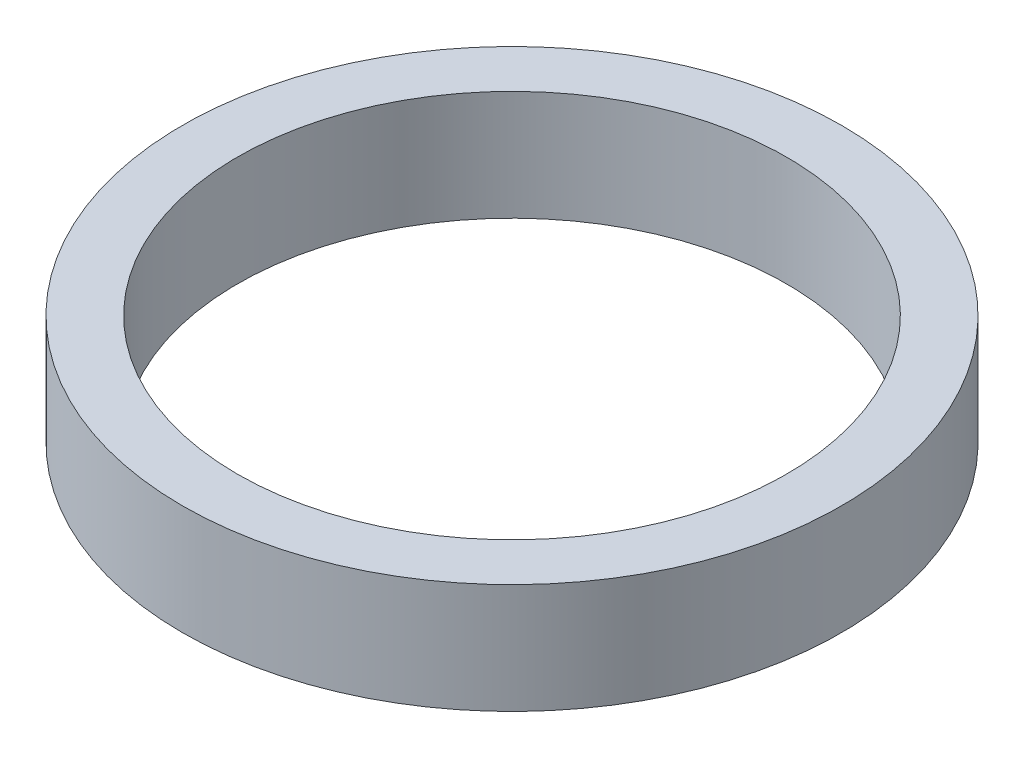
ISO-10303-21;
HEADER;
FILE_DESCRIPTION(('STEP AP214'),'2;1');
FILE_NAME('part.step','',(''),(''),'','','');
FILE_SCHEMA(('AUTOMOTIVE_DESIGN { 1 0 10303 214 1 1 1 1 }'));
ENDSEC;
DATA;
#1=APPLICATION_CONTEXT('core data for automotive mechanical design processes');
#2=APPLICATION_PROTOCOL_DEFINITION('international standard','automotive_design',2000,#1);
#3=PRODUCT_CONTEXT('',#1,'mechanical');
#4=PRODUCT('Part','Part','',(#3));
#5=PRODUCT_RELATED_PRODUCT_CATEGORY('part','',(#4));
#6=PRODUCT_DEFINITION_FORMATION('','',#4);
#7=PRODUCT_DEFINITION_CONTEXT('part definition',#1,'design');
#8=PRODUCT_DEFINITION('design','',#6,#7);
#9=PRODUCT_DEFINITION_SHAPE('','',#8);
#10=(LENGTH_UNIT() NAMED_UNIT(*) SI_UNIT(.MILLI.,.METRE.));
#11=(NAMED_UNIT(*) PLANE_ANGLE_UNIT() SI_UNIT($,.RADIAN.));
#12=(NAMED_UNIT(*) SI_UNIT($,.STERADIAN.) SOLID_ANGLE_UNIT());
#13=UNCERTAINTY_MEASURE_WITH_UNIT(LENGTH_MEASURE(1.E-05),#10,'distance_accuracy_value','');
#14=(GEOMETRIC_REPRESENTATION_CONTEXT(3) GLOBAL_UNCERTAINTY_ASSIGNED_CONTEXT((#13)) GLOBAL_UNIT_ASSIGNED_CONTEXT((#10,
#11,#12)) REPRESENTATION_CONTEXT('',''));
#15=CARTESIAN_POINT('',(0.,0.,0.));
#16=DIRECTION('',(0.,0.,1.));
#17=DIRECTION('',(1.,0.,0.));
#18=AXIS2_PLACEMENT_3D('',#15,#16,#17);
#19=CARTESIAN_POINT('',(0.,20.,0.));
#20=DIRECTION('',(0.,-1.,0.));
#21=DIRECTION('',(0.,0.,-1.));
#22=AXIS2_PLACEMENT_3D('',#19,#20,#21);
#23=CYLINDRICAL_SURFACE('',#22,60.);
#24=CARTESIAN_POINT('',(0.,20.,0.));
#25=DIRECTION('',(0.,1.,0.));
#26=DIRECTION('',(0.,0.,1.));
#27=AXIS2_PLACEMENT_3D('',#24,#25,#26);
#28=CIRCLE('',#27,60.);
#29=CARTESIAN_POINT('',(0.,20.,60.));
#30=VERTEX_POINT('',#29);
#31=EDGE_CURVE('E10',#30,#30,#28,.T.);
#32=ORIENTED_EDGE('',*,*,#31,.F.);
#33=EDGE_LOOP('',(#32));
#34=FACE_BOUND('',#33,.T.);
#35=CARTESIAN_POINT('',(0.,0.,0.));
#36=DIRECTION('',(0.,1.,0.));
#37=DIRECTION('',(0.,0.,1.));
#38=AXIS2_PLACEMENT_3D('',#35,#36,#37);
#39=CIRCLE('',#38,60.);
#40=CARTESIAN_POINT('',(0.,0.,60.));
#41=VERTEX_POINT('',#40);
#42=EDGE_CURVE('E37',#41,#41,#39,.T.);
#43=ORIENTED_EDGE('',*,*,#42,.T.);
#44=EDGE_LOOP('',(#43));
#45=FACE_BOUND('',#44,.T.);
#46=ADVANCED_FACE('F40',(#34,#45),#23,.T.);
#47=CARTESIAN_POINT('',(0.,20.,0.));
#48=DIRECTION('',(0.,1.,0.));
#49=DIRECTION('',(0.,0.,1.));
#50=AXIS2_PLACEMENT_3D('',#47,#48,#49);
#51=PLANE('',#50);
#52=CARTESIAN_POINT('',(0.,20.,0.));
#53=DIRECTION('',(0.,1.,0.));
#54=DIRECTION('',(0.,0.,1.));
#55=AXIS2_PLACEMENT_3D('',#52,#53,#54);
#56=CIRCLE('',#55,50.);
#57=CARTESIAN_POINT('',(0.,20.,50.));
#58=VERTEX_POINT('',#57);
#59=EDGE_CURVE('E50',#58,#58,#56,.T.);
#60=ORIENTED_EDGE('',*,*,#59,.F.);
#61=EDGE_LOOP('',(#60));
#62=FACE_BOUND('',#61,.T.);
#63=ORIENTED_EDGE('',*,*,#31,.T.);
#64=EDGE_LOOP('',(#63));
#65=FACE_BOUND('',#64,.T.);
#66=ADVANCED_FACE('F59',(#62,#65),#51,.T.);
#67=CARTESIAN_POINT('',(0.,0.,0.));
#68=DIRECTION('',(0.,1.,0.));
#69=DIRECTION('',(0.,0.,1.));
#70=AXIS2_PLACEMENT_3D('',#67,#68,#69);
#71=PLANE('',#70);
#72=CARTESIAN_POINT('',(0.,0.,0.));
#73=DIRECTION('',(0.,1.,0.));
#74=DIRECTION('',(0.,0.,1.));
#75=AXIS2_PLACEMENT_3D('',#72,#73,#74);
#76=CIRCLE('',#75,50.);
#77=CARTESIAN_POINT('',(0.,0.,50.));
#78=VERTEX_POINT('',#77);
#79=EDGE_CURVE('E47',#78,#78,#76,.T.);
#80=ORIENTED_EDGE('',*,*,#79,.T.);
#81=EDGE_LOOP('',(#80));
#82=FACE_BOUND('',#81,.T.);
#83=ORIENTED_EDGE('',*,*,#42,.F.);
#84=EDGE_LOOP('',(#83));
#85=FACE_BOUND('',#84,.T.);
#86=ADVANCED_FACE('F58',(#82,#85),#71,.F.);
#87=CARTESIAN_POINT('',(0.,20.,0.));
#88=DIRECTION('',(0.,-1.,0.));
#89=DIRECTION('',(0.,0.,-1.));
#90=AXIS2_PLACEMENT_3D('',#87,#88,#89);
#91=CYLINDRICAL_SURFACE('',#90,50.);
#92=ORIENTED_EDGE('',*,*,#59,.T.);
#93=EDGE_LOOP('',(#92));
#94=FACE_BOUND('',#93,.T.);
#95=ORIENTED_EDGE('',*,*,#79,.F.);
#96=EDGE_LOOP('',(#95));
#97=FACE_BOUND('',#96,.T.);
#98=ADVANCED_FACE('F54',(#94,#97),#91,.F.);
#99=CLOSED_SHELL('',(#46,#66,#86,#98));
#100=MANIFOLD_SOLID_BREP('B2',#99);
#101=ADVANCED_BREP_SHAPE_REPRESENTATION('',(#18,#100),#14);
#102=SHAPE_DEFINITION_REPRESENTATION(#9,#101);
ENDSEC;
END-ISO-10303-21;
